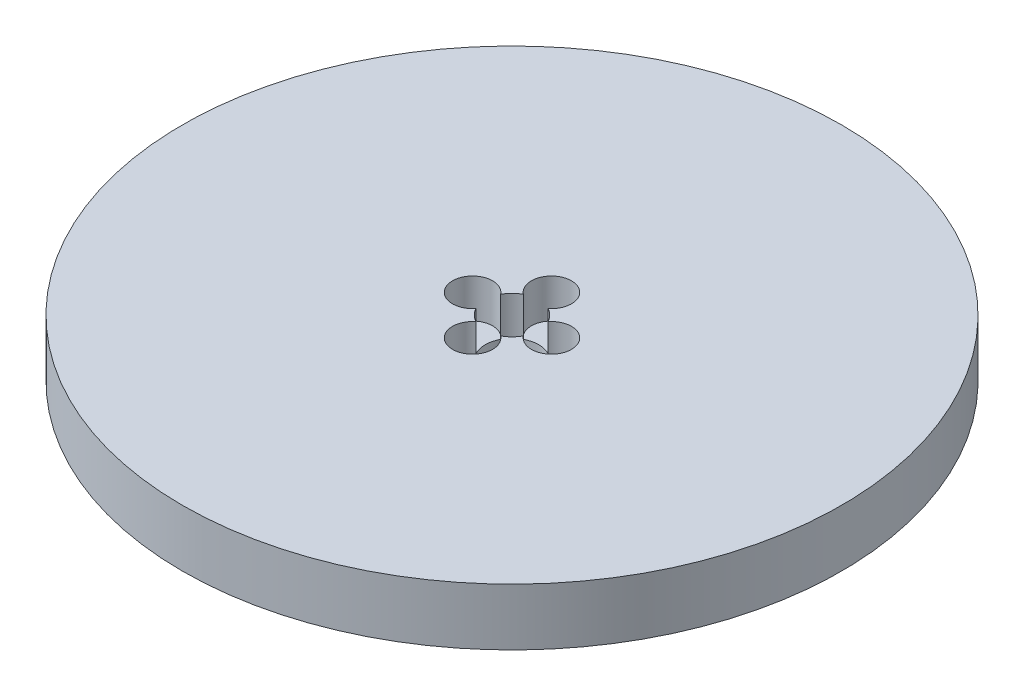
ISO-10303-21;
HEADER;
FILE_DESCRIPTION(('STEP AP214'),'2;1');
FILE_NAME('part.step','',(''),(''),'','','');
FILE_SCHEMA(('AUTOMOTIVE_DESIGN { 1 0 10303 214 1 1 1 1 }'));
ENDSEC;
DATA;
#1=APPLICATION_CONTEXT('core data for automotive mechanical design processes');
#2=APPLICATION_PROTOCOL_DEFINITION('international standard','automotive_design',2000,#1);
#3=PRODUCT_CONTEXT('',#1,'mechanical');
#4=PRODUCT('Part','Part','',(#3));
#5=PRODUCT_RELATED_PRODUCT_CATEGORY('part','',(#4));
#6=PRODUCT_DEFINITION_FORMATION('','',#4);
#7=PRODUCT_DEFINITION_CONTEXT('part definition',#1,'design');
#8=PRODUCT_DEFINITION('design','',#6,#7);
#9=PRODUCT_DEFINITION_SHAPE('','',#8);
#10=(LENGTH_UNIT() NAMED_UNIT(*) SI_UNIT(.MILLI.,.METRE.));
#11=(NAMED_UNIT(*) PLANE_ANGLE_UNIT() SI_UNIT($,.RADIAN.));
#12=(NAMED_UNIT(*) SI_UNIT($,.STERADIAN.) SOLID_ANGLE_UNIT());
#13=UNCERTAINTY_MEASURE_WITH_UNIT(LENGTH_MEASURE(1.E-05),#10,'distance_accuracy_value','');
#14=(GEOMETRIC_REPRESENTATION_CONTEXT(3) GLOBAL_UNCERTAINTY_ASSIGNED_CONTEXT((#13)) GLOBAL_UNIT_ASSIGNED_CONTEXT((#10,
#11,#12)) REPRESENTATION_CONTEXT('',''));
#15=CARTESIAN_POINT('',(0.,0.,0.));
#16=DIRECTION('',(0.,0.,1.));
#17=DIRECTION('',(1.,0.,0.));
#18=AXIS2_PLACEMENT_3D('',#15,#16,#17);
#19=CARTESIAN_POINT('',(0.,16.,0.));
#20=DIRECTION('',(0.,-1.,0.));
#21=DIRECTION('',(0.,0.,-1.));
#22=AXIS2_PLACEMENT_3D('',#19,#20,#21);
#23=CYLINDRICAL_SURFACE('',#22,92.5);
#24=CARTESIAN_POINT('',(0.,16.,0.));
#25=DIRECTION('',(0.,1.,0.));
#26=DIRECTION('',(0.,0.,1.));
#27=AXIS2_PLACEMENT_3D('',#24,#25,#26);
#28=CIRCLE('',#27,92.5);
#29=CARTESIAN_POINT('',(0.,16.,92.5));
#30=VERTEX_POINT('',#29);
#31=EDGE_CURVE('E141',#30,#30,#28,.T.);
#32=ORIENTED_EDGE('',*,*,#31,.F.);
#33=EDGE_LOOP('',(#32));
#34=FACE_BOUND('',#33,.T.);
#35=CARTESIAN_POINT('',(0.,0.,0.));
#36=DIRECTION('',(0.,1.,0.));
#37=DIRECTION('',(0.,0.,1.));
#38=AXIS2_PLACEMENT_3D('',#35,#36,#37);
#39=CIRCLE('',#38,92.5);
#40=CARTESIAN_POINT('',(0.,0.,92.5));
#41=VERTEX_POINT('',#40);
#42=EDGE_CURVE('E135',#41,#41,#39,.T.);
#43=ORIENTED_EDGE('',*,*,#42,.T.);
#44=EDGE_LOOP('',(#43));
#45=FACE_BOUND('',#44,.T.);
#46=ADVANCED_FACE('F39',(#34,#45),#23,.T.);
#47=CARTESIAN_POINT('',(0.,16.,0.));
#48=DIRECTION('',(0.,1.,0.));
#49=DIRECTION('',(0.,0.,1.));
#50=AXIS2_PLACEMENT_3D('',#47,#48,#49);
#51=PLANE('',#50);
#52=CARTESIAN_POINT('',(11.0697792240387,16.,0.));
#53=DIRECTION('',(0.,1.,0.));
#54=DIRECTION('',(0.,0.,-1.));
#55=AXIS2_PLACEMENT_3D('',#52,#53,#54);
#56=CIRCLE('',#55,5.61872268273517);
#57=CARTESIAN_POINT('',(6.64963431085322,16.,3.46876974328416));
#58=VERTEX_POINT('',#57);
#59=CARTESIAN_POINT('',(6.64963431085322,16.,-3.46876974328416));
#60=VERTEX_POINT('',#59);
#61=EDGE_CURVE('E126',#58,#60,#56,.T.);
#62=ORIENTED_EDGE('',*,*,#61,.F.);
#63=CARTESIAN_POINT('',(0.,16.,0.));
#64=DIRECTION('',(0.,1.,0.));
#65=DIRECTION('',(0.,0.,1.));
#66=AXIS2_PLACEMENT_3D('',#63,#64,#65);
#67=CIRCLE('',#66,7.5);
#68=CARTESIAN_POINT('',(3.46876974328418,16.,6.64963431085321));
#69=VERTEX_POINT('',#68);
#70=EDGE_CURVE('E121',#69,#58,#67,.T.);
#71=ORIENTED_EDGE('',*,*,#70,.F.);
#72=CARTESIAN_POINT('',(0.,16.,11.0697792240387));
#73=DIRECTION('',(0.,1.,0.));
#74=DIRECTION('',(1.,0.,0.));
#75=AXIS2_PLACEMENT_3D('',#72,#73,#74);
#76=CIRCLE('',#75,5.61872268273517);
#77=CARTESIAN_POINT('',(-3.46876974328414,16.,6.64963431085323));
#78=VERTEX_POINT('',#77);
#79=EDGE_CURVE('E105',#78,#69,#76,.T.);
#80=ORIENTED_EDGE('',*,*,#79,.F.);
#81=CARTESIAN_POINT('',(-6.64963431085322,16.,3.46876974328416));
#82=VERTEX_POINT('',#81);
#83=EDGE_CURVE('E129',#82,#78,#67,.T.);
#84=ORIENTED_EDGE('',*,*,#83,.F.);
#85=CARTESIAN_POINT('',(-11.0697792240387,16.,0.));
#86=DIRECTION('',(0.,1.,0.));
#87=DIRECTION('',(0.,0.,1.));
#88=AXIS2_PLACEMENT_3D('',#85,#86,#87);
#89=CIRCLE('',#88,5.61872268273517);
#90=CARTESIAN_POINT('',(-6.64963431085322,16.,-3.46876974328416));
#91=VERTEX_POINT('',#90);
#92=EDGE_CURVE('E140',#91,#82,#89,.T.);
#93=ORIENTED_EDGE('',*,*,#92,.F.);
#94=CARTESIAN_POINT('',(-3.46876974328423,16.,-6.64963431085318));
#95=VERTEX_POINT('',#94);
#96=EDGE_CURVE('E132',#95,#91,#67,.T.);
#97=ORIENTED_EDGE('',*,*,#96,.F.);
#98=CARTESIAN_POINT('',(-1.15949782757533E-13,16.,-11.0697792240387));
#99=DIRECTION('',(0.,1.,0.));
#100=DIRECTION('',(-1.,0.,0.));
#101=AXIS2_PLACEMENT_3D('',#98,#99,#100);
#102=CIRCLE('',#101,5.61872268273517);
#103=CARTESIAN_POINT('',(3.46876974328409,16.,-6.64963431085325));
#104=VERTEX_POINT('',#103);
#105=EDGE_CURVE('E226',#104,#95,#102,.T.);
#106=ORIENTED_EDGE('',*,*,#105,.F.);
#107=EDGE_CURVE('E128',#60,#104,#67,.T.);
#108=ORIENTED_EDGE('',*,*,#107,.F.);
#109=EDGE_LOOP('',(#62,#71,#80,#84,#93,#97,#106,#108));
#110=FACE_BOUND('',#109,.T.);
#111=ORIENTED_EDGE('',*,*,#31,.T.);
#112=EDGE_LOOP('',(#111));
#113=FACE_BOUND('',#112,.T.);
#114=ADVANCED_FACE('F124',(#110,#113),#51,.T.);
#115=CARTESIAN_POINT('',(0.,0.,0.));
#116=DIRECTION('',(0.,1.,0.));
#117=DIRECTION('',(0.,0.,1.));
#118=AXIS2_PLACEMENT_3D('',#115,#116,#117);
#119=PLANE('',#118);
#120=CARTESIAN_POINT('',(0.,0.,0.));
#121=DIRECTION('',(0.,1.,0.));
#122=DIRECTION('',(0.,0.,1.));
#123=AXIS2_PLACEMENT_3D('',#120,#121,#122);
#124=CIRCLE('',#123,7.5);
#125=CARTESIAN_POINT('',(0.,0.,7.5));
#126=VERTEX_POINT('',#125);
#127=EDGE_CURVE('E138',#126,#126,#124,.T.);
#128=ORIENTED_EDGE('',*,*,#127,.T.);
#129=EDGE_LOOP('',(#128));
#130=FACE_BOUND('',#129,.T.);
#131=ORIENTED_EDGE('',*,*,#42,.F.);
#132=EDGE_LOOP('',(#131));
#133=FACE_BOUND('',#132,.T.);
#134=ADVANCED_FACE('F186',(#130,#133),#119,.F.);
#135=CARTESIAN_POINT('',(0.,16.,0.));
#136=DIRECTION('',(0.,-1.,0.));
#137=DIRECTION('',(0.,0.,-1.));
#138=AXIS2_PLACEMENT_3D('',#135,#136,#137);
#139=CYLINDRICAL_SURFACE('',#138,7.5);
#140=DIRECTION('',(0.,1.,0.));
#141=VECTOR('',#140,1.);
#142=CARTESIAN_POINT('',(6.64963431085322,10.5263710174574,3.46876974328416));
#143=LINE('',#142,#141);
#144=CARTESIAN_POINT('',(6.64963431085322,5.05274203491488,3.46876974328416));
#145=VERTEX_POINT('',#144);
#146=EDGE_CURVE('E11',#145,#58,#143,.T.);
#147=ORIENTED_EDGE('',*,*,#146,.F.);
#148=CARTESIAN_POINT('',(0.,5.05274203491488,0.));
#149=DIRECTION('',(0.,1.,0.));
#150=DIRECTION('',(0.,0.,1.));
#151=AXIS2_PLACEMENT_3D('',#148,#149,#150);
#152=CIRCLE('',#151,7.5);
#153=CARTESIAN_POINT('',(6.64963431085322,5.05274203491488,-3.46876974328416));
#154=VERTEX_POINT('',#153);
#155=EDGE_CURVE('E167',#145,#154,#152,.T.);
#156=ORIENTED_EDGE('',*,*,#155,.T.);
#157=DIRECTION('',(0.,1.,0.));
#158=VECTOR('',#157,1.);
#159=CARTESIAN_POINT('',(6.64963431085322,10.5263710174574,-3.46876974328416));
#160=LINE('',#159,#158);
#161=EDGE_CURVE('E46',#60,#154,#160,.F.);
#162=ORIENTED_EDGE('',*,*,#161,.F.);
#163=ORIENTED_EDGE('',*,*,#107,.T.);
#164=DIRECTION('',(0.,1.,0.));
#165=VECTOR('',#164,1.);
#166=CARTESIAN_POINT('',(3.46876974328409,10.5263710174574,-6.64963431085325));
#167=LINE('',#166,#165);
#168=CARTESIAN_POINT('',(3.46876974328409,5.05274203491488,-6.64963431085325));
#169=VERTEX_POINT('',#168);
#170=EDGE_CURVE('E163',#169,#104,#167,.T.);
#171=ORIENTED_EDGE('',*,*,#170,.F.);
#172=CARTESIAN_POINT('',(0.,5.05274203491488,0.));
#173=DIRECTION('',(0.,1.,0.));
#174=DIRECTION('',(0.,0.,1.));
#175=AXIS2_PLACEMENT_3D('',#172,#173,#174);
#176=CIRCLE('',#175,7.5);
#177=CARTESIAN_POINT('',(-3.46876974328423,5.05274203491488,-6.64963431085318));
#178=VERTEX_POINT('',#177);
#179=EDGE_CURVE('E157',#169,#178,#176,.T.);
#180=ORIENTED_EDGE('',*,*,#179,.T.);
#181=DIRECTION('',(0.,1.,0.));
#182=VECTOR('',#181,1.);
#183=CARTESIAN_POINT('',(-3.46876974328423,10.5263710174574,-6.64963431085318));
#184=LINE('',#183,#182);
#185=EDGE_CURVE('E165',#95,#178,#184,.F.);
#186=ORIENTED_EDGE('',*,*,#185,.F.);
#187=ORIENTED_EDGE('',*,*,#96,.T.);
#188=DIRECTION('',(0.,1.,0.));
#189=VECTOR('',#188,1.);
#190=CARTESIAN_POINT('',(-6.64963431085322,10.5263710174574,-3.46876974328416));
#191=LINE('',#190,#189);
#192=CARTESIAN_POINT('',(-6.64963431085322,5.05274203491488,-3.46876974328416));
#193=VERTEX_POINT('',#192);
#194=EDGE_CURVE('E152',#193,#91,#191,.T.);
#195=ORIENTED_EDGE('',*,*,#194,.F.);
#196=CARTESIAN_POINT('',(0.,5.05274203491488,0.));
#197=DIRECTION('',(0.,1.,0.));
#198=DIRECTION('',(0.,0.,1.));
#199=AXIS2_PLACEMENT_3D('',#196,#197,#198);
#200=CIRCLE('',#199,7.5);
#201=CARTESIAN_POINT('',(-6.64963431085322,5.05274203491488,3.46876974328416));
#202=VERTEX_POINT('',#201);
#203=EDGE_CURVE('E148',#193,#202,#200,.T.);
#204=ORIENTED_EDGE('',*,*,#203,.T.);
#205=DIRECTION('',(0.,1.,0.));
#206=VECTOR('',#205,1.);
#207=CARTESIAN_POINT('',(-6.64963431085322,10.5263710174574,3.46876974328416));
#208=LINE('',#207,#206);
#209=EDGE_CURVE('E151',#82,#202,#208,.F.);
#210=ORIENTED_EDGE('',*,*,#209,.F.);
#211=ORIENTED_EDGE('',*,*,#83,.T.);
#212=DIRECTION('',(0.,1.,0.));
#213=VECTOR('',#212,1.);
#214=CARTESIAN_POINT('',(-3.46876974328414,10.5263710174574,6.64963431085323));
#215=LINE('',#214,#213);
#216=CARTESIAN_POINT('',(-3.46876974328414,5.05274203491488,6.64963431085323));
#217=VERTEX_POINT('',#216);
#218=EDGE_CURVE('E108',#217,#78,#215,.T.);
#219=ORIENTED_EDGE('',*,*,#218,.F.);
#220=CARTESIAN_POINT('',(0.,5.05274203491488,0.));
#221=DIRECTION('',(0.,1.,0.));
#222=DIRECTION('',(0.,0.,1.));
#223=AXIS2_PLACEMENT_3D('',#220,#221,#222);
#224=CIRCLE('',#223,7.5);
#225=CARTESIAN_POINT('',(3.46876974328418,5.05274203491488,6.64963431085321));
#226=VERTEX_POINT('',#225);
#227=EDGE_CURVE('E125',#217,#226,#224,.T.);
#228=ORIENTED_EDGE('',*,*,#227,.T.);
#229=DIRECTION('',(0.,1.,0.));
#230=VECTOR('',#229,1.);
#231=CARTESIAN_POINT('',(3.46876974328418,10.5263710174574,6.64963431085321));
#232=LINE('',#231,#230);
#233=EDGE_CURVE('E106',#69,#226,#232,.F.);
#234=ORIENTED_EDGE('',*,*,#233,.F.);
#235=ORIENTED_EDGE('',*,*,#70,.T.);
#236=EDGE_LOOP('',(#147,#156,#162,#163,#171,#180,#186,#187,#195,#204,#210,#211,#219,#228,#234,#235));
#237=FACE_BOUND('',#236,.T.);
#238=ORIENTED_EDGE('',*,*,#127,.F.);
#239=EDGE_LOOP('',(#238));
#240=FACE_BOUND('',#239,.T.);
#241=ADVANCED_FACE('F118',(#237,#240),#139,.F.);
#242=CARTESIAN_POINT('',(-11.0697792240387,5.05274203491488,0.));
#243=DIRECTION('',(0.,1.,0.));
#244=DIRECTION('',(0.,0.,1.));
#245=AXIS2_PLACEMENT_3D('',#242,#243,#244);
#246=CYLINDRICAL_SURFACE('',#245,5.61872268273517);
#247=ORIENTED_EDGE('',*,*,#194,.T.);
#248=ORIENTED_EDGE('',*,*,#92,.T.);
#249=ORIENTED_EDGE('',*,*,#209,.T.);
#250=CARTESIAN_POINT('',(-11.0697792240387,5.05274203491488,0.));
#251=DIRECTION('',(0.,1.,0.));
#252=DIRECTION('',(0.,0.,1.));
#253=AXIS2_PLACEMENT_3D('',#250,#251,#252);
#254=CIRCLE('',#253,5.61872268273517);
#255=EDGE_CURVE('E142',#193,#202,#254,.T.);
#256=ORIENTED_EDGE('',*,*,#255,.F.);
#257=EDGE_LOOP('',(#247,#248,#249,#256));
#258=FACE_BOUND('',#257,.T.);
#259=ADVANCED_FACE('F197',(#258),#246,.F.);
#260=CARTESIAN_POINT('',(-11.0697792240387,5.05274203491488,0.));
#261=DIRECTION('',(0.,1.,0.));
#262=DIRECTION('',(0.,0.,1.));
#263=AXIS2_PLACEMENT_3D('',#260,#261,#262);
#264=PLANE('',#263);
#265=ORIENTED_EDGE('',*,*,#255,.T.);
#266=ORIENTED_EDGE('',*,*,#203,.F.);
#267=EDGE_LOOP('',(#265,#266));
#268=FACE_BOUND('',#267,.T.);
#269=ADVANCED_FACE('F203',(#268),#264,.T.);
#270=CARTESIAN_POINT('',(0.,5.05274203491488,11.0697792240387));
#271=DIRECTION('',(0.,1.,0.));
#272=DIRECTION('',(0.,0.,1.));
#273=AXIS2_PLACEMENT_3D('',#270,#271,#272);
#274=CYLINDRICAL_SURFACE('',#273,5.61872268273517);
#275=ORIENTED_EDGE('',*,*,#218,.T.);
#276=ORIENTED_EDGE('',*,*,#79,.T.);
#277=ORIENTED_EDGE('',*,*,#233,.T.);
#278=CARTESIAN_POINT('',(0.,5.05274203491488,11.0697792240387));
#279=DIRECTION('',(0.,1.,0.));
#280=DIRECTION('',(1.,0.,0.));
#281=AXIS2_PLACEMENT_3D('',#278,#279,#280);
#282=CIRCLE('',#281,5.61872268273517);
#283=EDGE_CURVE('E111',#217,#226,#282,.T.);
#284=ORIENTED_EDGE('',*,*,#283,.F.);
#285=EDGE_LOOP('',(#275,#276,#277,#284));
#286=FACE_BOUND('',#285,.T.);
#287=ADVANCED_FACE('F102',(#286),#274,.F.);
#288=CARTESIAN_POINT('',(0.,5.05274203491488,11.0697792240387));
#289=DIRECTION('',(0.,1.,0.));
#290=DIRECTION('',(1.,0.,0.));
#291=AXIS2_PLACEMENT_3D('',#288,#289,#290);
#292=PLANE('',#291);
#293=ORIENTED_EDGE('',*,*,#283,.T.);
#294=ORIENTED_EDGE('',*,*,#227,.F.);
#295=EDGE_LOOP('',(#293,#294));
#296=FACE_BOUND('',#295,.T.);
#297=ADVANCED_FACE('F208',(#296),#292,.T.);
#298=CARTESIAN_POINT('',(-1.15949782757533E-13,5.05274203491488,-11.0697792240387));
#299=DIRECTION('',(0.,1.,0.));
#300=DIRECTION('',(0.,0.,1.));
#301=AXIS2_PLACEMENT_3D('',#298,#299,#300);
#302=CYLINDRICAL_SURFACE('',#301,5.61872268273517);
#303=ORIENTED_EDGE('',*,*,#170,.T.);
#304=ORIENTED_EDGE('',*,*,#105,.T.);
#305=ORIENTED_EDGE('',*,*,#185,.T.);
#306=CARTESIAN_POINT('',(-1.15949782757533E-13,5.05274203491488,-11.0697792240387));
#307=DIRECTION('',(0.,1.,0.));
#308=DIRECTION('',(-1.,0.,0.));
#309=AXIS2_PLACEMENT_3D('',#306,#307,#308);
#310=CIRCLE('',#309,5.61872268273517);
#311=EDGE_CURVE('E56',#169,#178,#310,.T.);
#312=ORIENTED_EDGE('',*,*,#311,.F.);
#313=EDGE_LOOP('',(#303,#304,#305,#312));
#314=FACE_BOUND('',#313,.T.);
#315=ADVANCED_FACE('F209',(#314),#302,.F.);
#316=CARTESIAN_POINT('',(-1.15949782757533E-13,5.05274203491488,-11.0697792240387));
#317=DIRECTION('',(0.,1.,0.));
#318=DIRECTION('',(-1.,0.,0.));
#319=AXIS2_PLACEMENT_3D('',#316,#317,#318);
#320=PLANE('',#319);
#321=ORIENTED_EDGE('',*,*,#311,.T.);
#322=ORIENTED_EDGE('',*,*,#179,.F.);
#323=EDGE_LOOP('',(#321,#322));
#324=FACE_BOUND('',#323,.T.);
#325=ADVANCED_FACE('F180',(#324),#320,.T.);
#326=CARTESIAN_POINT('',(11.0697792240387,5.05274203491488,0.));
#327=DIRECTION('',(0.,1.,0.));
#328=DIRECTION('',(0.,0.,1.));
#329=AXIS2_PLACEMENT_3D('',#326,#327,#328);
#330=CYLINDRICAL_SURFACE('',#329,5.61872268273517);
#331=ORIENTED_EDGE('',*,*,#146,.T.);
#332=ORIENTED_EDGE('',*,*,#61,.T.);
#333=ORIENTED_EDGE('',*,*,#161,.T.);
#334=CARTESIAN_POINT('',(11.0697792240387,5.05274203491488,0.));
#335=DIRECTION('',(0.,1.,0.));
#336=DIRECTION('',(0.,0.,-1.));
#337=AXIS2_PLACEMENT_3D('',#334,#335,#336);
#338=CIRCLE('',#337,5.61872268273517);
#339=EDGE_CURVE('E55',#145,#154,#338,.T.);
#340=ORIENTED_EDGE('',*,*,#339,.F.);
#341=EDGE_LOOP('',(#331,#332,#333,#340));
#342=FACE_BOUND('',#341,.T.);
#343=ADVANCED_FACE('F168',(#342),#330,.F.);
#344=CARTESIAN_POINT('',(11.0697792240387,5.05274203491488,0.));
#345=DIRECTION('',(0.,1.,0.));
#346=DIRECTION('',(0.,0.,-1.));
#347=AXIS2_PLACEMENT_3D('',#344,#345,#346);
#348=PLANE('',#347);
#349=ORIENTED_EDGE('',*,*,#339,.T.);
#350=ORIENTED_EDGE('',*,*,#155,.F.);
#351=EDGE_LOOP('',(#349,#350));
#352=FACE_BOUND('',#351,.T.);
#353=ADVANCED_FACE('F171',(#352),#348,.T.);
#354=CLOSED_SHELL('',(#46,#114,#134,#241,#259,#269,#287,#297,#315,#325,#343,#353));
#355=MANIFOLD_SOLID_BREP('B2',#354);
#356=ADVANCED_BREP_SHAPE_REPRESENTATION('',(#18,#355),#14);
#357=SHAPE_DEFINITION_REPRESENTATION(#9,#356);
ENDSEC;
END-ISO-10303-21;
